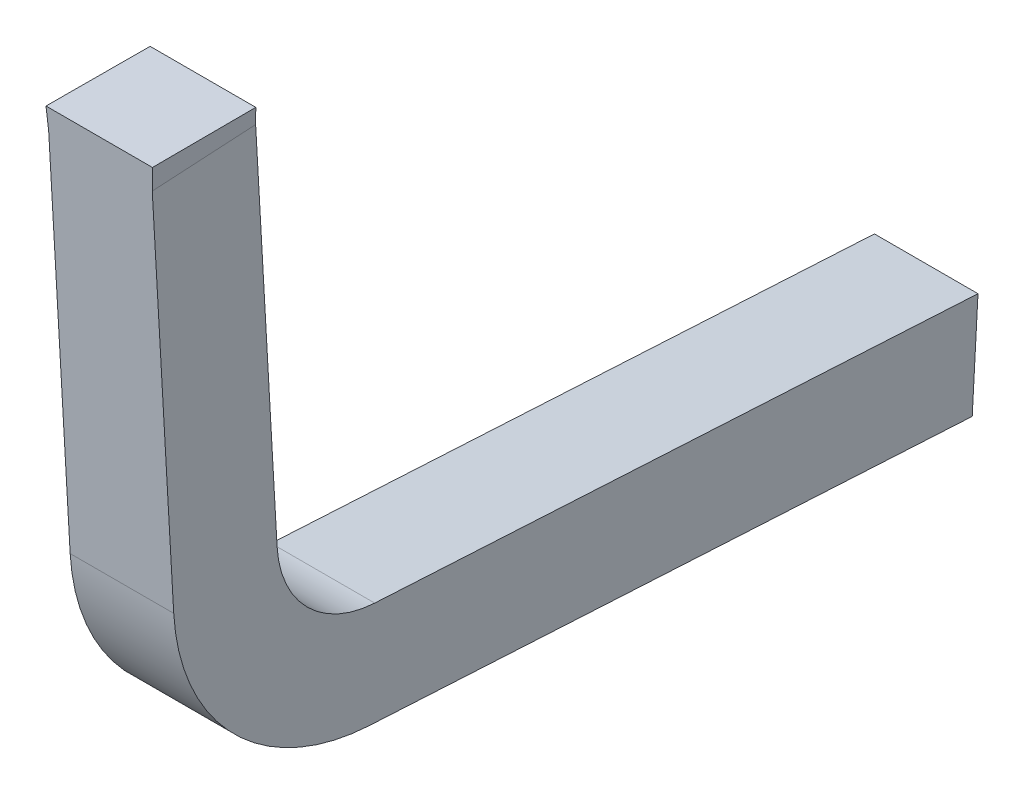
ISO-10303-21;
HEADER;
FILE_DESCRIPTION(('STEP AP214'),'2;1');
FILE_NAME('part.step','',(''),(''),'','','');
FILE_SCHEMA(('AUTOMOTIVE_DESIGN { 1 0 10303 214 1 1 1 1 }'));
ENDSEC;
DATA;
#1=APPLICATION_CONTEXT('core data for automotive mechanical design processes');
#2=APPLICATION_PROTOCOL_DEFINITION('international standard','automotive_design',2000,#1);
#3=PRODUCT_CONTEXT('',#1,'mechanical');
#4=PRODUCT('Part','Part','',(#3));
#5=PRODUCT_RELATED_PRODUCT_CATEGORY('part','',(#4));
#6=PRODUCT_DEFINITION_FORMATION('','',#4);
#7=PRODUCT_DEFINITION_CONTEXT('part definition',#1,'design');
#8=PRODUCT_DEFINITION('design','',#6,#7);
#9=PRODUCT_DEFINITION_SHAPE('','',#8);
#10=(LENGTH_UNIT() NAMED_UNIT(*) SI_UNIT(.MILLI.,.METRE.));
#11=(NAMED_UNIT(*) PLANE_ANGLE_UNIT() SI_UNIT($,.RADIAN.));
#12=(NAMED_UNIT(*) SI_UNIT($,.STERADIAN.) SOLID_ANGLE_UNIT());
#13=UNCERTAINTY_MEASURE_WITH_UNIT(LENGTH_MEASURE(1.E-05),#10,'distance_accuracy_value','');
#14=(GEOMETRIC_REPRESENTATION_CONTEXT(3) GLOBAL_UNCERTAINTY_ASSIGNED_CONTEXT((#13)) GLOBAL_UNIT_ASSIGNED_CONTEXT((#10,
#11,#12)) REPRESENTATION_CONTEXT('',''));
#15=CARTESIAN_POINT('',(0.,0.,0.));
#16=DIRECTION('',(0.,0.,1.));
#17=DIRECTION('',(1.,0.,0.));
#18=AXIS2_PLACEMENT_3D('',#15,#16,#17);
#19=CARTESIAN_POINT('',(1.398593165818,-2.29897527843,-10.34781984343));
#20=DIRECTION('',(0.997785157857701,0.0664110878974701,0.003787632922693));
#21=DIRECTION('',(-0.0664115642747469,0.997792315129046,0.));
#22=AXIS2_PLACEMENT_3D('',#19,#20,#21);
#23=PLANE('',#22);
#24=DIRECTION('',(0.,-0.0569406083110753,0.998377567418842));
#25=VECTOR('',#24,1.);
#26=CARTESIAN_POINT('',(1.4,-2.314349492935,-10.44885919008));
#27=LINE('',#26,#25);
#28=CARTESIAN_POINT('',(1.4,-2.31434949293492,-10.4488591900814));
#29=VERTEX_POINT('',#28);
#30=CARTESIAN_POINT('',(1.4,-2.32573761459728,-10.2491836765951));
#31=VERTEX_POINT('',#30);
#32=EDGE_CURVE('E98',#29,#31,#27,.T.);
#33=ORIENTED_EDGE('',*,*,#32,.T.);
#34=DIRECTION('',(0.0665190105147783,-0.996166318707982,-0.056814493854309));
#35=VECTOR('',#34,1.);
#36=CARTESIAN_POINT('',(1.397186331635,-2.28360106392498,-10.2467804967704));
#37=LINE('',#36,#35);
#38=CARTESIAN_POINT('',(1.397186331635,-2.28360106392499,-10.2467804967704));
#39=VERTEX_POINT('',#38);
#40=EDGE_CURVE('E148',#39,#31,#37,.T.);
#41=ORIENTED_EDGE('',*,*,#40,.F.);
#42=DIRECTION('',(-0.00379601320157547,0.,0.999992795115932));
#43=VECTOR('',#42,1.);
#44=CARTESIAN_POINT('',(1.397946773511,-2.283601063925,-10.4471055106));
#45=LINE('',#44,#43);
#46=CARTESIAN_POINT('',(1.397946773511,-2.28360106392489,-10.4471055106019));
#47=VERTEX_POINT('',#46);
#48=EDGE_CURVE('E161',#47,#39,#45,.T.);
#49=ORIENTED_EDGE('',*,*,#48,.F.);
#50=DIRECTION('',(0.0665190105273673,-0.996166318707226,-0.0568144938528306));
#51=VECTOR('',#50,1.);
#52=CARTESIAN_POINT('',(1.397946773511,-2.28360106392483,-10.4471055106029));
#53=LINE('',#52,#51);
#54=EDGE_CURVE('E103',#47,#29,#53,.T.);
#55=ORIENTED_EDGE('',*,*,#54,.T.);
#56=EDGE_LOOP('',(#33,#41,#49,#55));
#57=FACE_BOUND('',#56,.T.);
#58=ADVANCED_FACE('F17',(#57),#23,.F.);
#59=CARTESIAN_POINT('',(1.5,-2.283601063925,-10.34694300368));
#60=DIRECTION('',(0.,1.,0.));
#61=DIRECTION('',(0.,0.,1.));
#62=AXIS2_PLACEMENT_3D('',#59,#60,#61);
#63=PLANE('',#62);
#64=DIRECTION('',(1.,0.,0.));
#65=VECTOR('',#64,1.);
#66=CARTESIAN_POINT('',(1.5,-2.28360106392498,-10.2467804967704));
#67=LINE('',#66,#65);
#68=CARTESIAN_POINT('',(1.60281366836524,-2.283601063925,-10.2467804967704));
#69=VERTEX_POINT('',#68);
#70=EDGE_CURVE('E154',#69,#39,#67,.F.);
#71=ORIENTED_EDGE('',*,*,#70,.F.);
#72=DIRECTION('',(0.0037960132042621,-1.7968426456006E-13,0.999992795115921));
#73=VECTOR('',#72,1.);
#74=CARTESIAN_POINT('',(1.6020532264892,-2.28360106392501,-10.4471055106));
#75=LINE('',#74,#73);
#76=CARTESIAN_POINT('',(1.60205322648913,-2.28360106392495,-10.447105510601));
#77=VERTEX_POINT('',#76);
#78=EDGE_CURVE('E119',#77,#69,#75,.T.);
#79=ORIENTED_EDGE('',*,*,#78,.F.);
#80=DIRECTION('',(1.,0.,0.));
#81=VECTOR('',#80,1.);
#82=CARTESIAN_POINT('',(1.5,-2.28360106392483,-10.4471055106029));
#83=LINE('',#82,#81);
#84=EDGE_CURVE('E125',#77,#47,#83,.F.);
#85=ORIENTED_EDGE('',*,*,#84,.T.);
#86=ORIENTED_EDGE('',*,*,#48,.T.);
#87=EDGE_LOOP('',(#71,#79,#85,#86));
#88=FACE_BOUND('',#87,.T.);
#89=ADVANCED_FACE('F243',(#88),#63,.T.);
#90=CARTESIAN_POINT('',(1.4,-2.909472777839,-11.05227927458));
#91=DIRECTION('',(1.,0.,0.));
#92=DIRECTION('',(0.,0.,-1.));
#93=AXIS2_PLACEMENT_3D('',#90,#91,#92);
#94=PLANE('',#93);
#95=CARTESIAN_POINT('',(1.4,-3.03,-10.69));
#96=DIRECTION('',(-1.,0.,0.));
#97=DIRECTION('',(0.,0.,1.));
#98=AXIS2_PLACEMENT_3D('',#95,#96,#97);
#99=CIRCLE('',#98,0.4);
#100=CARTESIAN_POINT('',(1.4,-3.05277624331319,-10.2906489730306));
#101=VERTEX_POINT('',#100);
#102=CARTESIAN_POINT('',(1.4,-3.42937693582933,-10.6676826720305));
#103=VERTEX_POINT('',#102);
#104=EDGE_CURVE('E142',#101,#103,#99,.F.);
#105=ORIENTED_EDGE('',*,*,#104,.F.);
#106=DIRECTION('',(0.,-0.998377567418718,-0.056940608313261));
#107=VECTOR('',#106,1.);
#108=CARTESIAN_POINT('',(1.4,-2.668188653621,-10.2687147349));
#109=LINE('',#108,#107);
#110=EDGE_CURVE('E145',#31,#101,#109,.T.);
#111=ORIENTED_EDGE('',*,*,#110,.F.);
#112=ORIENTED_EDGE('',*,*,#32,.F.);
#113=DIRECTION('',(0.,-0.998377567418801,-0.0569406083117901));
#114=VECTOR('',#113,1.);
#115=CARTESIAN_POINT('',(1.4,-2.662494592804,-10.46871499856));
#116=LINE('',#115,#114);
#117=CARTESIAN_POINT('',(1.4,-3.04138812167726,-10.4903244865168));
#118=VERTEX_POINT('',#117);
#119=EDGE_CURVE('E92',#29,#118,#116,.T.);
#120=ORIENTED_EDGE('',*,*,#119,.T.);
#121=CARTESIAN_POINT('',(1.4,-3.03,-10.69));
#122=DIRECTION('',(-1.,0.,0.));
#123=DIRECTION('',(0.,0.,1.));
#124=AXIS2_PLACEMENT_3D('',#121,#122,#123);
#125=CIRCLE('',#124,0.2);
#126=CARTESIAN_POINT('',(1.4,-3.22968846791482,-10.6788413360177));
#127=VERTEX_POINT('',#126);
#128=EDGE_CURVE('E20',#118,#127,#125,.F.);
#129=ORIENTED_EDGE('',*,*,#128,.T.);
#130=DIRECTION('',(0.,0.0557933199228295,0.998442339572991));
#131=VECTOR('',#130,1.);
#132=CARTESIAN_POINT('',(1.4,-3.262244863925,-11.26145022621));
#133=LINE('',#132,#131);
#134=CARTESIAN_POINT('',(1.4,-3.29480125993501,-11.8440591164004));
#135=VERTEX_POINT('',#134);
#136=EDGE_CURVE('E111',#135,#127,#133,.T.);
#137=ORIENTED_EDGE('',*,*,#136,.F.);
#138=DIRECTION('',(0.,-0.998442339574031,0.0557933199042218));
#139=VECTOR('',#138,1.);
#140=CARTESIAN_POINT('',(1.4,-3.394645493892,-11.83847978441));
#141=LINE('',#140,#139);
#142=CARTESIAN_POINT('',(1.4,-3.49448972784906,-11.8329004524196));
#143=VERTEX_POINT('',#142);
#144=EDGE_CURVE('E135',#135,#143,#141,.T.);
#145=ORIENTED_EDGE('',*,*,#144,.T.);
#146=DIRECTION('',(0.,0.055793319922371,0.998442339573017));
#147=VECTOR('',#146,1.);
#148=CARTESIAN_POINT('',(1.4,-3.461933331839,-11.25029156222));
#149=LINE('',#148,#147);
#150=EDGE_CURVE('E140',#143,#103,#149,.T.);
#151=ORIENTED_EDGE('',*,*,#150,.T.);
#152=EDGE_LOOP('',(#105,#111,#112,#120,#129,#137,#145,#151));
#153=FACE_BOUND('',#152,.T.);
#154=ADVANCED_FACE('F95',(#153),#94,.F.);
#155=CARTESIAN_POINT('',(1.5,-3.262244863925,-11.26145022621));
#156=DIRECTION('',(0.,0.998442339572991,-0.0557933199228295));
#157=DIRECTION('',(0.,0.0557933199228295,0.998442339572991));
#158=AXIS2_PLACEMENT_3D('',#155,#156,#157);
#159=PLANE('',#158);
#160=DIRECTION('',(0.,0.055793319922887,0.998442339572988));
#161=VECTOR('',#160,1.);
#162=CARTESIAN_POINT('',(1.6,-3.294801259935,-11.8440591164));
#163=LINE('',#162,#161);
#164=CARTESIAN_POINT('',(1.6,-3.29480125993501,-11.8440591164001));
#165=VERTEX_POINT('',#164);
#166=CARTESIAN_POINT('',(1.6,-3.2296884679148,-10.6788413360177));
#167=VERTEX_POINT('',#166);
#168=EDGE_CURVE('E129',#165,#167,#163,.T.);
#169=ORIENTED_EDGE('',*,*,#168,.F.);
#170=DIRECTION('',(1.,0.,0.));
#171=VECTOR('',#170,1.);
#172=CARTESIAN_POINT('',(1.5,-3.29480125993502,-11.8440591164004));
#173=LINE('',#172,#171);
#174=EDGE_CURVE('E126',#165,#135,#173,.F.);
#175=ORIENTED_EDGE('',*,*,#174,.T.);
#176=ORIENTED_EDGE('',*,*,#136,.T.);
#177=DIRECTION('',(-1.,0.,0.));
#178=VECTOR('',#177,1.);
#179=CARTESIAN_POINT('',(1.604,-3.22968846791485,-10.67884133602));
#180=LINE('',#179,#178);
#181=EDGE_CURVE('E110',#127,#167,#180,.F.);
#182=ORIENTED_EDGE('',*,*,#181,.T.);
#183=EDGE_LOOP('',(#169,#175,#176,#182));
#184=FACE_BOUND('',#183,.T.);
#185=ADVANCED_FACE('F234',(#184),#159,.T.);
#186=CARTESIAN_POINT('',(1.604,-3.03,-10.69));
#187=DIRECTION('',(-1.,0.,0.));
#188=DIRECTION('',(0.,0.,1.));
#189=AXIS2_PLACEMENT_3D('',#186,#187,#188);
#190=CYLINDRICAL_SURFACE('',#189,0.2);
#191=ORIENTED_EDGE('',*,*,#128,.F.);
#192=DIRECTION('',(1.,0.,0.));
#193=VECTOR('',#192,1.);
#194=CARTESIAN_POINT('',(1.5,-3.04138812169214,-10.4903244865176));
#195=LINE('',#194,#193);
#196=CARTESIAN_POINT('',(1.6,-3.04138812167779,-10.490324486518));
#197=VERTEX_POINT('',#196);
#198=EDGE_CURVE('E102',#118,#197,#195,.T.);
#199=ORIENTED_EDGE('',*,*,#198,.T.);
#200=CARTESIAN_POINT('',(1.6,-3.03,-10.69));
#201=DIRECTION('',(-1.,0.,0.));
#202=DIRECTION('',(0.,0.,1.));
#203=AXIS2_PLACEMENT_3D('',#200,#201,#202);
#204=CIRCLE('',#203,0.2);
#205=EDGE_CURVE('E185',#167,#197,#204,.T.);
#206=ORIENTED_EDGE('',*,*,#205,.F.);
#207=ORIENTED_EDGE('',*,*,#181,.F.);
#208=EDGE_LOOP('',(#191,#199,#206,#207));
#209=FACE_BOUND('',#208,.T.);
#210=ADVANCED_FACE('F107',(#209),#190,.F.);
#211=CARTESIAN_POINT('',(1.5,-2.662494592804,-10.46871499856));
#212=DIRECTION('',(0.,-0.0569406083117901,0.998377567418801));
#213=DIRECTION('',(0.,-0.998377567418801,-0.0569406083117901));
#214=AXIS2_PLACEMENT_3D('',#211,#212,#213);
#215=PLANE('',#214);
#216=DIRECTION('',(0.,0.998377567418456,0.0569406083178453));
#217=VECTOR('',#216,1.);
#218=CARTESIAN_POINT('',(1.6,-3.041388121692,-10.49032448652));
#219=LINE('',#218,#217);
#220=CARTESIAN_POINT('',(1.60000000000008,-2.314349492934,-10.44885919008));
#221=VERTEX_POINT('',#220);
#222=EDGE_CURVE('E114',#197,#221,#219,.T.);
#223=ORIENTED_EDGE('',*,*,#222,.F.);
#224=ORIENTED_EDGE('',*,*,#198,.F.);
#225=ORIENTED_EDGE('',*,*,#119,.F.);
#226=ORIENTED_EDGE('',*,*,#54,.F.);
#227=ORIENTED_EDGE('',*,*,#84,.F.);
#228=DIRECTION('',(0.0665190105284185,0.996166318705548,0.0568144938810224));
#229=VECTOR('',#228,1.);
#230=CARTESIAN_POINT('',(1.60000000000023,-2.31434949293401,-10.44885919008));
#231=LINE('',#230,#229);
#232=EDGE_CURVE('E116',#221,#77,#231,.T.);
#233=ORIENTED_EDGE('',*,*,#232,.F.);
#234=EDGE_LOOP('',(#223,#224,#225,#226,#227,#233));
#235=FACE_BOUND('',#234,.T.);
#236=ADVANCED_FACE('F112',(#235),#215,.F.);
#237=CARTESIAN_POINT('',(1.601406834183,-2.298975278429,-10.34781984343));
#238=DIRECTION('',(0.9977851578563,-0.06641108791847,-0.003787632923708));
#239=DIRECTION('',(0.0664115642957473,0.997792315127648,0.));
#240=AXIS2_PLACEMENT_3D('',#237,#238,#239);
#241=PLANE('',#240);
#242=ORIENTED_EDGE('',*,*,#232,.T.);
#243=ORIENTED_EDGE('',*,*,#78,.T.);
#244=DIRECTION('',(0.0665190105179116,0.996166318707773,0.0568144938543194));
#245=VECTOR('',#244,1.);
#246=CARTESIAN_POINT('',(1.6,-2.32573761459528,-10.249183676595));
#247=LINE('',#246,#245);
#248=CARTESIAN_POINT('',(1.6,-2.32573761459509,-10.2491836765983));
#249=VERTEX_POINT('',#248);
#250=EDGE_CURVE('E147',#249,#69,#247,.T.);
#251=ORIENTED_EDGE('',*,*,#250,.F.);
#252=DIRECTION('',(0.,-0.0569406083060912,0.998377567419126));
#253=VECTOR('',#252,1.);
#254=CARTESIAN_POINT('',(1.6,-2.314349492934,-10.44885919008));
#255=LINE('',#254,#253);
#256=EDGE_CURVE('E200',#221,#249,#255,.T.);
#257=ORIENTED_EDGE('',*,*,#256,.F.);
#258=EDGE_LOOP('',(#242,#243,#251,#257));
#259=FACE_BOUND('',#258,.T.);
#260=ADVANCED_FACE('F258',(#259),#241,.T.);
#261=CARTESIAN_POINT('',(1.5,-2.668188653621,-10.2687147349));
#262=DIRECTION('',(0.,-0.056940608313261,0.998377567418718));
#263=DIRECTION('',(0.,-0.998377567418718,-0.056940608313261));
#264=AXIS2_PLACEMENT_3D('',#261,#262,#263);
#265=PLANE('',#264);
#266=ORIENTED_EDGE('',*,*,#250,.T.);
#267=ORIENTED_EDGE('',*,*,#70,.T.);
#268=ORIENTED_EDGE('',*,*,#40,.T.);
#269=ORIENTED_EDGE('',*,*,#110,.T.);
#270=DIRECTION('',(-1.,0.,0.));
#271=VECTOR('',#270,1.);
#272=CARTESIAN_POINT('',(1.604,-3.05277624330094,-10.2906489730311));
#273=LINE('',#272,#271);
#274=CARTESIAN_POINT('',(1.6,-3.05277624331214,-10.2906489730312));
#275=VERTEX_POINT('',#274);
#276=EDGE_CURVE('E157',#275,#101,#273,.T.);
#277=ORIENTED_EDGE('',*,*,#276,.F.);
#278=DIRECTION('',(0.,-0.998377567419005,-0.0569406083082185));
#279=VECTOR('',#278,1.);
#280=CARTESIAN_POINT('',(1.6,-2.325737614595,-10.2491836766));
#281=LINE('',#280,#279);
#282=EDGE_CURVE('E184',#249,#275,#281,.T.);
#283=ORIENTED_EDGE('',*,*,#282,.F.);
#284=EDGE_LOOP('',(#266,#267,#268,#269,#277,#283));
#285=FACE_BOUND('',#284,.T.);
#286=ADVANCED_FACE('F227',(#285),#265,.T.);
#287=CARTESIAN_POINT('',(1.604,-3.03,-10.69));
#288=DIRECTION('',(-1.,0.,0.));
#289=DIRECTION('',(0.,0.,1.));
#290=AXIS2_PLACEMENT_3D('',#287,#288,#289);
#291=CYLINDRICAL_SURFACE('',#290,0.4);
#292=DIRECTION('',(1.,0.,0.));
#293=VECTOR('',#292,1.);
#294=CARTESIAN_POINT('',(1.5,-3.4293769358293,-10.66768267203));
#295=LINE('',#294,#293);
#296=CARTESIAN_POINT('',(1.6,-3.42937693582946,-10.6676826720306));
#297=VERTEX_POINT('',#296);
#298=EDGE_CURVE('E137',#103,#297,#295,.T.);
#299=ORIENTED_EDGE('',*,*,#298,.T.);
#300=CARTESIAN_POINT('',(1.6,-3.03,-10.69));
#301=DIRECTION('',(-1.,0.,0.));
#302=DIRECTION('',(0.,0.,1.));
#303=AXIS2_PLACEMENT_3D('',#300,#301,#302);
#304=CIRCLE('',#303,0.4);
#305=EDGE_CURVE('E181',#275,#297,#304,.F.);
#306=ORIENTED_EDGE('',*,*,#305,.F.);
#307=ORIENTED_EDGE('',*,*,#276,.T.);
#308=ORIENTED_EDGE('',*,*,#104,.T.);
#309=EDGE_LOOP('',(#299,#306,#307,#308));
#310=FACE_BOUND('',#309,.T.);
#311=ADVANCED_FACE('F220',(#310),#291,.T.);
#312=CARTESIAN_POINT('',(1.5,-3.461933331839,-11.25029156222));
#313=DIRECTION('',(0.,0.998442339573017,-0.055793319922371));
#314=DIRECTION('',(0.,0.055793319922371,0.998442339573017));
#315=AXIS2_PLACEMENT_3D('',#312,#313,#314);
#316=PLANE('',#315);
#317=ORIENTED_EDGE('',*,*,#298,.F.);
#318=ORIENTED_EDGE('',*,*,#150,.F.);
#319=DIRECTION('',(1.,0.,0.));
#320=VECTOR('',#319,1.);
#321=CARTESIAN_POINT('',(1.5,-3.49448972784898,-11.8329004524196));
#322=LINE('',#321,#320);
#323=CARTESIAN_POINT('',(1.6,-3.49448972784899,-11.8329004524199));
#324=VERTEX_POINT('',#323);
#325=EDGE_CURVE('E35',#143,#324,#322,.T.);
#326=ORIENTED_EDGE('',*,*,#325,.T.);
#327=DIRECTION('',(0.,-0.0557933199219327,-0.998442339573042));
#328=VECTOR('',#327,1.);
#329=CARTESIAN_POINT('',(1.6,-3.429376935829,-10.66768267202));
#330=LINE('',#329,#328);
#331=EDGE_CURVE('E26',#297,#324,#330,.T.);
#332=ORIENTED_EDGE('',*,*,#331,.F.);
#333=EDGE_LOOP('',(#317,#318,#326,#332));
#334=FACE_BOUND('',#333,.T.);
#335=ADVANCED_FACE('F222',(#334),#316,.F.);
#336=CARTESIAN_POINT('',(1.5,-3.394645493892,-11.83847978441));
#337=DIRECTION('',(0.,0.0557933199042218,0.998442339574031));
#338=DIRECTION('',(0.,-0.998442339574031,0.0557933199042218));
#339=AXIS2_PLACEMENT_3D('',#336,#337,#338);
#340=PLANE('',#339);
#341=DIRECTION('',(0.,0.998442339574254,-0.0557933199002383));
#342=VECTOR('',#341,1.);
#343=CARTESIAN_POINT('',(1.6,-3.494489727849,-11.83290045242));
#344=LINE('',#343,#342);
#345=EDGE_CURVE('E11',#324,#165,#344,.T.);
#346=ORIENTED_EDGE('',*,*,#345,.F.);
#347=ORIENTED_EDGE('',*,*,#325,.F.);
#348=ORIENTED_EDGE('',*,*,#144,.F.);
#349=ORIENTED_EDGE('',*,*,#174,.F.);
#350=EDGE_LOOP('',(#346,#347,#348,#349));
#351=FACE_BOUND('',#350,.T.);
#352=ADVANCED_FACE('F230',(#351),#340,.F.);
#353=CARTESIAN_POINT('',(1.6,-2.909472777838,-11.05227927458));
#354=DIRECTION('',(1.,0.,0.));
#355=DIRECTION('',(0.,0.,-1.));
#356=AXIS2_PLACEMENT_3D('',#353,#354,#355);
#357=PLANE('',#356);
#358=ORIENTED_EDGE('',*,*,#331,.T.);
#359=ORIENTED_EDGE('',*,*,#345,.T.);
#360=ORIENTED_EDGE('',*,*,#168,.T.);
#361=ORIENTED_EDGE('',*,*,#205,.T.);
#362=ORIENTED_EDGE('',*,*,#222,.T.);
#363=ORIENTED_EDGE('',*,*,#256,.T.);
#364=ORIENTED_EDGE('',*,*,#282,.T.);
#365=ORIENTED_EDGE('',*,*,#305,.T.);
#366=EDGE_LOOP('',(#358,#359,#360,#361,#362,#363,#364,#365));
#367=FACE_BOUND('',#366,.T.);
#368=ADVANCED_FACE('F224',(#367),#357,.T.);
#369=CLOSED_SHELL('',(#58,#89,#154,#185,#210,#236,#260,#286,#311,#335,#352,#368));
#370=MANIFOLD_SOLID_BREP('B1',#369);
#371=ADVANCED_BREP_SHAPE_REPRESENTATION('',(#18,#370),#14);
#372=SHAPE_DEFINITION_REPRESENTATION(#9,#371);
ENDSEC;
END-ISO-10303-21;
